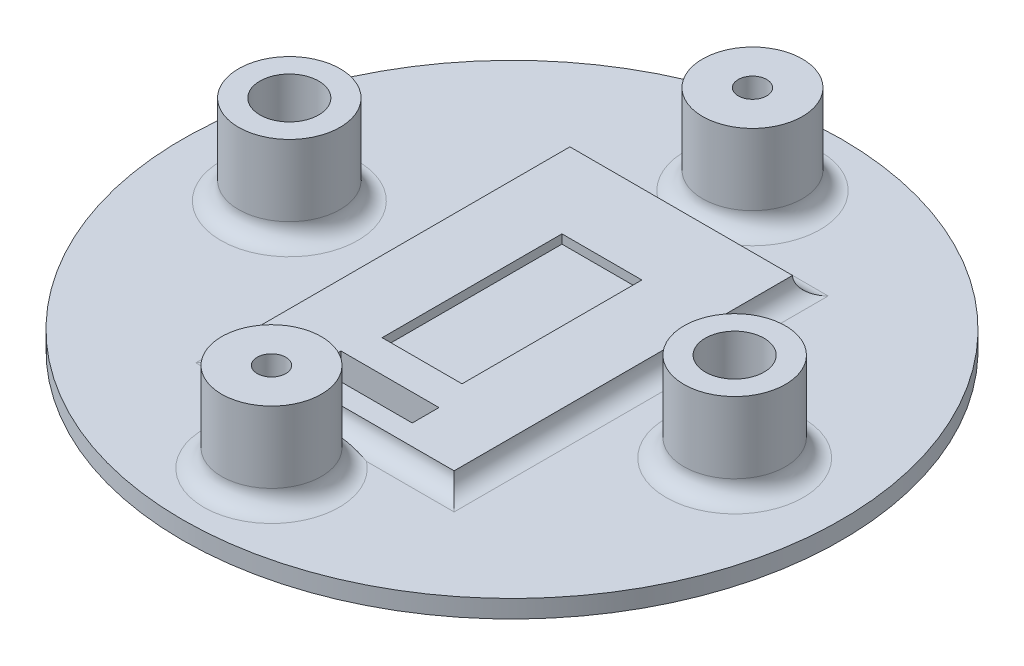
ISO-10303-21;
HEADER;
FILE_DESCRIPTION(('STEP AP214'),'2;1');
FILE_NAME('part.step','',(''),(''),'','','');
FILE_SCHEMA(('AUTOMOTIVE_DESIGN { 1 0 10303 214 1 1 1 1 }'));
ENDSEC;
DATA;
#1=APPLICATION_CONTEXT('core data for automotive mechanical design processes');
#2=APPLICATION_PROTOCOL_DEFINITION('international standard','automotive_design',2000,#1);
#3=PRODUCT_CONTEXT('',#1,'mechanical');
#4=PRODUCT('Part','Part','',(#3));
#5=PRODUCT_RELATED_PRODUCT_CATEGORY('part','',(#4));
#6=PRODUCT_DEFINITION_FORMATION('','',#4);
#7=PRODUCT_DEFINITION_CONTEXT('part definition',#1,'design');
#8=PRODUCT_DEFINITION('design','',#6,#7);
#9=PRODUCT_DEFINITION_SHAPE('','',#8);
#10=(LENGTH_UNIT() NAMED_UNIT(*) SI_UNIT(.MILLI.,.METRE.));
#11=(NAMED_UNIT(*) PLANE_ANGLE_UNIT() SI_UNIT($,.RADIAN.));
#12=(NAMED_UNIT(*) SI_UNIT($,.STERADIAN.) SOLID_ANGLE_UNIT());
#13=UNCERTAINTY_MEASURE_WITH_UNIT(LENGTH_MEASURE(1.E-05),#10,'distance_accuracy_value','');
#14=(GEOMETRIC_REPRESENTATION_CONTEXT(3) GLOBAL_UNCERTAINTY_ASSIGNED_CONTEXT((#13)) GLOBAL_UNIT_ASSIGNED_CONTEXT((#10,
#11,#12)) REPRESENTATION_CONTEXT('',''));
#15=CARTESIAN_POINT('',(0.,0.,0.));
#16=DIRECTION('',(0.,0.,1.));
#17=DIRECTION('',(1.,0.,0.));
#18=AXIS2_PLACEMENT_3D('',#15,#16,#17);
#19=CARTESIAN_POINT('',(0.,12.,-27.));
#20=DIRECTION('',(0.,-1.,0.));
#21=DIRECTION('',(0.,0.,-1.));
#22=AXIS2_PLACEMENT_3D('',#19,#20,#21);
#23=CYLINDRICAL_SURFACE('',#22,1.6);
#24=CARTESIAN_POINT('',(0.,12.,-27.));
#25=DIRECTION('',(0.,1.,0.));
#26=DIRECTION('',(0.,0.,1.));
#27=AXIS2_PLACEMENT_3D('',#24,#25,#26);
#28=CIRCLE('',#27,1.6);
#29=CARTESIAN_POINT('',(0.,12.,-25.4));
#30=VERTEX_POINT('',#29);
#31=EDGE_CURVE('E204',#30,#30,#28,.T.);
#32=ORIENTED_EDGE('',*,*,#31,.T.);
#33=EDGE_LOOP('',(#32));
#34=FACE_BOUND('',#33,.T.);
#35=CARTESIAN_POINT('',(0.,3.75,-27.));
#36=DIRECTION('',(0.,-1.,0.));
#37=DIRECTION('',(0.,0.,-1.));
#38=AXIS2_PLACEMENT_3D('',#35,#36,#37);
#39=CIRCLE('',#38,1.6);
#40=CARTESIAN_POINT('',(0.,3.75,-28.6));
#41=VERTEX_POINT('',#40);
#42=EDGE_CURVE('E188',#41,#41,#39,.F.);
#43=ORIENTED_EDGE('',*,*,#42,.F.);
#44=EDGE_LOOP('',(#43));
#45=FACE_BOUND('',#44,.T.);
#46=ADVANCED_FACE('F33',(#34,#45),#23,.F.);
#47=CARTESIAN_POINT('',(0.,12.,27.));
#48=DIRECTION('',(0.,-1.,0.));
#49=DIRECTION('',(0.,0.,-1.));
#50=AXIS2_PLACEMENT_3D('',#47,#48,#49);
#51=CYLINDRICAL_SURFACE('',#50,1.6);
#52=CARTESIAN_POINT('',(0.,12.,27.));
#53=DIRECTION('',(0.,1.,0.));
#54=DIRECTION('',(0.,0.,1.));
#55=AXIS2_PLACEMENT_3D('',#52,#53,#54);
#56=CIRCLE('',#55,1.6);
#57=CARTESIAN_POINT('',(0.,12.,28.6));
#58=VERTEX_POINT('',#57);
#59=EDGE_CURVE('E198',#58,#58,#56,.T.);
#60=ORIENTED_EDGE('',*,*,#59,.T.);
#61=EDGE_LOOP('',(#60));
#62=FACE_BOUND('',#61,.T.);
#63=CARTESIAN_POINT('',(0.,3.75,27.));
#64=DIRECTION('',(0.,-1.,0.));
#65=DIRECTION('',(0.,0.,-1.));
#66=AXIS2_PLACEMENT_3D('',#63,#64,#65);
#67=CIRCLE('',#66,1.6);
#68=CARTESIAN_POINT('',(0.,3.75,25.4));
#69=VERTEX_POINT('',#68);
#70=EDGE_CURVE('E194',#69,#69,#67,.F.);
#71=ORIENTED_EDGE('',*,*,#70,.F.);
#72=EDGE_LOOP('',(#71));
#73=FACE_BOUND('',#72,.T.);
#74=ADVANCED_FACE('F359',(#62,#73),#51,.F.);
#75=CARTESIAN_POINT('',(0.,2.,0.));
#76=DIRECTION('',(0.,1.,0.));
#77=DIRECTION('',(0.,0.,1.));
#78=AXIS2_PLACEMENT_3D('',#75,#76,#77);
#79=PLANE('',#78);
#80=CARTESIAN_POINT('',(25.,2.,0.));
#81=DIRECTION('',(0.,1.,0.));
#82=DIRECTION('',(0.,0.,1.));
#83=AXIS2_PLACEMENT_3D('',#80,#81,#82);
#84=CIRCLE('',#83,7.7);
#85=CARTESIAN_POINT('',(25.,2.,7.7));
#86=VERTEX_POINT('',#85);
#87=EDGE_CURVE('E299',#86,#86,#84,.F.);
#88=ORIENTED_EDGE('',*,*,#87,.T.);
#89=EDGE_LOOP('',(#88));
#90=FACE_BOUND('',#89,.T.);
#91=CARTESIAN_POINT('',(0.,2.,27.));
#92=DIRECTION('',(0.,1.,0.));
#93=DIRECTION('',(0.,0.,1.));
#94=AXIS2_PLACEMENT_3D('',#91,#92,#93);
#95=CIRCLE('',#94,7.6);
#96=CARTESIAN_POINT('',(4.66476151587624,2.,21.));
#97=VERTEX_POINT('',#96);
#98=CARTESIAN_POINT('',(0.,2.,34.6));
#99=VERTEX_POINT('',#98);
#100=EDGE_CURVE('E60',#97,#99,#95,.F.);
#101=ORIENTED_EDGE('',*,*,#100,.T.);
#102=CARTESIAN_POINT('',(0.,2.,27.));
#103=DIRECTION('',(0.,1.,0.));
#104=DIRECTION('',(0.,0.,1.));
#105=AXIS2_PLACEMENT_3D('',#102,#103,#104);
#106=CIRCLE('',#105,7.6);
#107=CARTESIAN_POINT('',(-4.66476151587624,2.,21.));
#108=VERTEX_POINT('',#107);
#109=EDGE_CURVE('E55',#99,#108,#106,.F.);
#110=ORIENTED_EDGE('',*,*,#109,.T.);
#111=DIRECTION('',(1.,0.,0.));
#112=VECTOR('',#111,1.);
#113=CARTESIAN_POINT('',(0.,2.,21.));
#114=LINE('',#113,#112);
#115=CARTESIAN_POINT('',(-14.5,2.,21.));
#116=VERTEX_POINT('',#115);
#117=EDGE_CURVE('E296',#108,#116,#114,.F.);
#118=ORIENTED_EDGE('',*,*,#117,.T.);
#119=DIRECTION('',(0.,0.,1.));
#120=VECTOR('',#119,1.);
#121=CARTESIAN_POINT('',(-14.5,2.,0.));
#122=LINE('',#121,#120);
#123=CARTESIAN_POINT('',(-14.5,2.,-21.));
#124=VERTEX_POINT('',#123);
#125=EDGE_CURVE('E293',#116,#124,#122,.F.);
#126=ORIENTED_EDGE('',*,*,#125,.T.);
#127=DIRECTION('',(-1.,0.,0.));
#128=VECTOR('',#127,1.);
#129=CARTESIAN_POINT('',(0.,2.,-21.));
#130=LINE('',#129,#128);
#131=CARTESIAN_POINT('',(-4.66476151587625,2.,-21.));
#132=VERTEX_POINT('',#131);
#133=EDGE_CURVE('E286',#124,#132,#130,.F.);
#134=ORIENTED_EDGE('',*,*,#133,.T.);
#135=CARTESIAN_POINT('',(0.,2.,-27.));
#136=DIRECTION('',(0.,1.,0.));
#137=DIRECTION('',(0.,0.,1.));
#138=AXIS2_PLACEMENT_3D('',#135,#136,#137);
#139=CIRCLE('',#138,7.6);
#140=CARTESIAN_POINT('',(4.66476151587625,2.,-21.));
#141=VERTEX_POINT('',#140);
#142=EDGE_CURVE('E282',#132,#141,#139,.F.);
#143=ORIENTED_EDGE('',*,*,#142,.T.);
#144=DIRECTION('',(-1.,0.,0.));
#145=VECTOR('',#144,1.);
#146=CARTESIAN_POINT('',(0.,2.,-21.));
#147=LINE('',#146,#145);
#148=CARTESIAN_POINT('',(14.5,2.,-21.));
#149=VERTEX_POINT('',#148);
#150=EDGE_CURVE('E284',#141,#149,#147,.F.);
#151=ORIENTED_EDGE('',*,*,#150,.T.);
#152=DIRECTION('',(0.,0.,-1.));
#153=VECTOR('',#152,1.);
#154=CARTESIAN_POINT('',(14.5,2.,0.));
#155=LINE('',#154,#153);
#156=CARTESIAN_POINT('',(14.5,2.,21.));
#157=VERTEX_POINT('',#156);
#158=EDGE_CURVE('E288',#149,#157,#155,.F.);
#159=ORIENTED_EDGE('',*,*,#158,.T.);
#160=DIRECTION('',(1.,0.,0.));
#161=VECTOR('',#160,1.);
#162=CARTESIAN_POINT('',(0.,2.,21.));
#163=LINE('',#162,#161);
#164=EDGE_CURVE('E291',#157,#97,#163,.F.);
#165=ORIENTED_EDGE('',*,*,#164,.T.);
#166=EDGE_LOOP('',(#101,#110,#118,#126,#134,#143,#151,#159,#165));
#167=FACE_BOUND('',#166,.T.);
#168=CARTESIAN_POINT('',(-25.,2.,0.));
#169=DIRECTION('',(0.,1.,0.));
#170=DIRECTION('',(0.,0.,1.));
#171=AXIS2_PLACEMENT_3D('',#168,#169,#170);
#172=CIRCLE('',#171,7.7);
#173=CARTESIAN_POINT('',(-25.,2.,7.7));
#174=VERTEX_POINT('',#173);
#175=EDGE_CURVE('E275',#174,#174,#172,.F.);
#176=ORIENTED_EDGE('',*,*,#175,.T.);
#177=EDGE_LOOP('',(#176));
#178=FACE_BOUND('',#177,.T.);
#179=CARTESIAN_POINT('',(0.,2.,0.));
#180=DIRECTION('',(0.,1.,0.));
#181=DIRECTION('',(0.,0.,1.));
#182=AXIS2_PLACEMENT_3D('',#179,#180,#181);
#183=CIRCLE('',#182,37.);
#184=CARTESIAN_POINT('',(0.,2.,37.));
#185=VERTEX_POINT('',#184);
#186=EDGE_CURVE('E264',#185,#185,#183,.T.);
#187=ORIENTED_EDGE('',*,*,#186,.T.);
#188=EDGE_LOOP('',(#187));
#189=FACE_BOUND('',#188,.T.);
#190=ADVANCED_FACE('F365',(#90,#167,#178,#189),#79,.T.);
#191=CARTESIAN_POINT('',(0.,2.,0.));
#192=DIRECTION('',(0.,-1.,0.));
#193=DIRECTION('',(0.,0.,-1.));
#194=AXIS2_PLACEMENT_3D('',#191,#192,#193);
#195=CYLINDRICAL_SURFACE('',#194,37.);
#196=ORIENTED_EDGE('',*,*,#186,.F.);
#197=EDGE_LOOP('',(#196));
#198=FACE_BOUND('',#197,.T.);
#199=CARTESIAN_POINT('',(0.,0.,0.));
#200=DIRECTION('',(0.,1.,0.));
#201=DIRECTION('',(0.,0.,1.));
#202=AXIS2_PLACEMENT_3D('',#199,#200,#201);
#203=CIRCLE('',#202,37.);
#204=CARTESIAN_POINT('',(0.,0.,37.));
#205=VERTEX_POINT('',#204);
#206=EDGE_CURVE('E263',#205,#205,#203,.T.);
#207=ORIENTED_EDGE('',*,*,#206,.T.);
#208=EDGE_LOOP('',(#207));
#209=FACE_BOUND('',#208,.T.);
#210=ADVANCED_FACE('F423',(#198,#209),#195,.T.);
#211=CARTESIAN_POINT('',(0.,0.,0.));
#212=DIRECTION('',(0.,1.,0.));
#213=DIRECTION('',(0.,0.,1.));
#214=AXIS2_PLACEMENT_3D('',#211,#212,#213);
#215=PLANE('',#214);
#216=CARTESIAN_POINT('',(0.,0.,-27.));
#217=DIRECTION('',(0.,-1.,0.));
#218=DIRECTION('',(0.,0.,-1.));
#219=AXIS2_PLACEMENT_3D('',#216,#217,#218);
#220=CIRCLE('',#219,3.75);
#221=CARTESIAN_POINT('',(0.,0.,-30.75));
#222=VERTEX_POINT('',#221);
#223=EDGE_CURVE('E181',#222,#222,#220,.T.);
#224=ORIENTED_EDGE('',*,*,#223,.F.);
#225=EDGE_LOOP('',(#224));
#226=FACE_BOUND('',#225,.T.);
#227=CARTESIAN_POINT('',(0.,0.,27.));
#228=DIRECTION('',(0.,-1.,0.));
#229=DIRECTION('',(0.,0.,-1.));
#230=AXIS2_PLACEMENT_3D('',#227,#228,#229);
#231=CIRCLE('',#230,3.75);
#232=CARTESIAN_POINT('',(0.,0.,23.25));
#233=VERTEX_POINT('',#232);
#234=EDGE_CURVE('E195',#233,#233,#231,.T.);
#235=ORIENTED_EDGE('',*,*,#234,.F.);
#236=EDGE_LOOP('',(#235));
#237=FACE_BOUND('',#236,.T.);
#238=DIRECTION('',(1.,0.,0.));
#239=VECTOR('',#238,1.);
#240=CARTESIAN_POINT('',(-5.49999999999999,0.,16.7));
#241=LINE('',#240,#239);
#242=CARTESIAN_POINT('',(-5.49999999999999,0.,16.7));
#243=VERTEX_POINT('',#242);
#244=CARTESIAN_POINT('',(5.50000000000001,0.,16.7));
#245=VERTEX_POINT('',#244);
#246=EDGE_CURVE('E221',#243,#245,#241,.T.);
#247=ORIENTED_EDGE('',*,*,#246,.T.);
#248=DIRECTION('',(0.,0.,-1.));
#249=VECTOR('',#248,1.);
#250=CARTESIAN_POINT('',(5.50000000000001,0.,16.7));
#251=LINE('',#250,#249);
#252=CARTESIAN_POINT('',(5.50000000000001,0.,13.7));
#253=VERTEX_POINT('',#252);
#254=EDGE_CURVE('E211',#245,#253,#251,.T.);
#255=ORIENTED_EDGE('',*,*,#254,.T.);
#256=DIRECTION('',(-1.,0.,0.));
#257=VECTOR('',#256,1.);
#258=CARTESIAN_POINT('',(-5.49999999999999,0.,13.7));
#259=LINE('',#258,#257);
#260=CARTESIAN_POINT('',(-5.49999999999999,0.,13.7));
#261=VERTEX_POINT('',#260);
#262=EDGE_CURVE('E214',#253,#261,#259,.T.);
#263=ORIENTED_EDGE('',*,*,#262,.T.);
#264=DIRECTION('',(0.,0.,1.));
#265=VECTOR('',#264,1.);
#266=CARTESIAN_POINT('',(-5.49999999999999,0.,16.7));
#267=LINE('',#266,#265);
#268=EDGE_CURVE('E218',#261,#243,#267,.T.);
#269=ORIENTED_EDGE('',*,*,#268,.T.);
#270=EDGE_LOOP('',(#247,#255,#263,#269));
#271=FACE_BOUND('',#270,.T.);
#272=ORIENTED_EDGE('',*,*,#206,.F.);
#273=EDGE_LOOP('',(#272));
#274=FACE_BOUND('',#273,.T.);
#275=ADVANCED_FACE('F416',(#226,#237,#271,#274),#215,.F.);
#276=CARTESIAN_POINT('',(-25.,12.,0.));
#277=DIRECTION('',(0.,1.,0.));
#278=DIRECTION('',(0.,0.,1.));
#279=AXIS2_PLACEMENT_3D('',#276,#277,#278);
#280=PLANE('',#279);
#281=CARTESIAN_POINT('',(-25.,12.,0.));
#282=DIRECTION('',(0.,1.,0.));
#283=DIRECTION('',(0.,0.,1.));
#284=AXIS2_PLACEMENT_3D('',#281,#282,#283);
#285=CIRCLE('',#284,5.7);
#286=CARTESIAN_POINT('',(-25.,12.,5.7));
#287=VERTEX_POINT('',#286);
#288=EDGE_CURVE('E260',#287,#287,#285,.T.);
#289=ORIENTED_EDGE('',*,*,#288,.T.);
#290=EDGE_LOOP('',(#289));
#291=FACE_BOUND('',#290,.T.);
#292=CARTESIAN_POINT('',(-25.,12.,0.));
#293=DIRECTION('',(0.,1.,0.));
#294=DIRECTION('',(0.,0.,1.));
#295=AXIS2_PLACEMENT_3D('',#292,#293,#294);
#296=CIRCLE('',#295,3.3);
#297=CARTESIAN_POINT('',(-25.,12.,3.30000000000001));
#298=VERTEX_POINT('',#297);
#299=EDGE_CURVE('E257',#298,#298,#296,.T.);
#300=ORIENTED_EDGE('',*,*,#299,.F.);
#301=EDGE_LOOP('',(#300));
#302=FACE_BOUND('',#301,.T.);
#303=ADVANCED_FACE('F413',(#291,#302),#280,.T.);
#304=CARTESIAN_POINT('',(-25.,12.,0.));
#305=DIRECTION('',(0.,-1.,0.));
#306=DIRECTION('',(0.,0.,-1.));
#307=AXIS2_PLACEMENT_3D('',#304,#305,#306);
#308=CYLINDRICAL_SURFACE('',#307,5.7);
#309=CARTESIAN_POINT('',(-25.,4.,0.));
#310=DIRECTION('',(0.,1.,0.));
#311=DIRECTION('',(0.,0.,1.));
#312=AXIS2_PLACEMENT_3D('',#309,#310,#311);
#313=CIRCLE('',#312,5.7);
#314=CARTESIAN_POINT('',(-25.,4.,5.7));
#315=VERTEX_POINT('',#314);
#316=EDGE_CURVE('E11',#315,#315,#313,.T.);
#317=ORIENTED_EDGE('',*,*,#316,.T.);
#318=EDGE_LOOP('',(#317));
#319=FACE_BOUND('',#318,.T.);
#320=ORIENTED_EDGE('',*,*,#288,.F.);
#321=EDGE_LOOP('',(#320));
#322=FACE_BOUND('',#321,.T.);
#323=ADVANCED_FACE('F411',(#319,#322),#308,.T.);
#324=CARTESIAN_POINT('',(-25.,12.,0.));
#325=DIRECTION('',(0.,-1.,0.));
#326=DIRECTION('',(0.,0.,-1.));
#327=AXIS2_PLACEMENT_3D('',#324,#325,#326);
#328=CYLINDRICAL_SURFACE('',#327,3.3);
#329=ORIENTED_EDGE('',*,*,#299,.T.);
#330=EDGE_LOOP('',(#329));
#331=FACE_BOUND('',#330,.T.);
#332=CARTESIAN_POINT('',(-25.,2.,0.));
#333=DIRECTION('',(0.,1.,0.));
#334=DIRECTION('',(0.,0.,1.));
#335=AXIS2_PLACEMENT_3D('',#332,#333,#334);
#336=CIRCLE('',#335,3.3);
#337=CARTESIAN_POINT('',(-25.,2.,3.30000000000001));
#338=VERTEX_POINT('',#337);
#339=EDGE_CURVE('E267',#338,#338,#336,.F.);
#340=ORIENTED_EDGE('',*,*,#339,.T.);
#341=EDGE_LOOP('',(#340));
#342=FACE_BOUND('',#341,.T.);
#343=ADVANCED_FACE('F408',(#331,#342),#328,.F.);
#344=ORIENTED_EDGE('',*,*,#339,.F.);
#345=EDGE_LOOP('',(#344));
#346=FACE_BOUND('',#345,.T.);
#347=ADVANCED_FACE('F403',(#346),#79,.T.);
#348=CARTESIAN_POINT('',(25.,12.,0.));
#349=DIRECTION('',(0.,1.,0.));
#350=DIRECTION('',(0.,0.,1.));
#351=AXIS2_PLACEMENT_3D('',#348,#349,#350);
#352=PLANE('',#351);
#353=CARTESIAN_POINT('',(25.,12.,0.));
#354=DIRECTION('',(0.,1.,0.));
#355=DIRECTION('',(0.,0.,1.));
#356=AXIS2_PLACEMENT_3D('',#353,#354,#355);
#357=CIRCLE('',#356,5.7);
#358=CARTESIAN_POINT('',(25.,12.,5.7));
#359=VERTEX_POINT('',#358);
#360=EDGE_CURVE('E254',#359,#359,#357,.T.);
#361=ORIENTED_EDGE('',*,*,#360,.T.);
#362=EDGE_LOOP('',(#361));
#363=FACE_BOUND('',#362,.T.);
#364=CARTESIAN_POINT('',(25.,12.,0.));
#365=DIRECTION('',(0.,1.,0.));
#366=DIRECTION('',(0.,0.,1.));
#367=AXIS2_PLACEMENT_3D('',#364,#365,#366);
#368=CIRCLE('',#367,3.3);
#369=CARTESIAN_POINT('',(25.,12.,3.30000000000001));
#370=VERTEX_POINT('',#369);
#371=EDGE_CURVE('E251',#370,#370,#368,.T.);
#372=ORIENTED_EDGE('',*,*,#371,.F.);
#373=EDGE_LOOP('',(#372));
#374=FACE_BOUND('',#373,.T.);
#375=ADVANCED_FACE('F400',(#363,#374),#352,.T.);
#376=CARTESIAN_POINT('',(25.,12.,0.));
#377=DIRECTION('',(0.,-1.,0.));
#378=DIRECTION('',(0.,0.,-1.));
#379=AXIS2_PLACEMENT_3D('',#376,#377,#378);
#380=CYLINDRICAL_SURFACE('',#379,5.7);
#381=CARTESIAN_POINT('',(25.,4.,0.));
#382=DIRECTION('',(0.,1.,0.));
#383=DIRECTION('',(0.,0.,1.));
#384=AXIS2_PLACEMENT_3D('',#381,#382,#383);
#385=CIRCLE('',#384,5.7);
#386=CARTESIAN_POINT('',(25.,4.,5.7));
#387=VERTEX_POINT('',#386);
#388=EDGE_CURVE('E305',#387,#387,#385,.T.);
#389=ORIENTED_EDGE('',*,*,#388,.T.);
#390=EDGE_LOOP('',(#389));
#391=FACE_BOUND('',#390,.T.);
#392=ORIENTED_EDGE('',*,*,#360,.F.);
#393=EDGE_LOOP('',(#392));
#394=FACE_BOUND('',#393,.T.);
#395=ADVANCED_FACE('F398',(#391,#394),#380,.T.);
#396=CARTESIAN_POINT('',(25.,12.,0.));
#397=DIRECTION('',(0.,-1.,0.));
#398=DIRECTION('',(0.,0.,-1.));
#399=AXIS2_PLACEMENT_3D('',#396,#397,#398);
#400=CYLINDRICAL_SURFACE('',#399,3.3);
#401=ORIENTED_EDGE('',*,*,#371,.T.);
#402=EDGE_LOOP('',(#401));
#403=FACE_BOUND('',#402,.T.);
#404=CARTESIAN_POINT('',(25.,2.,0.));
#405=DIRECTION('',(0.,1.,0.));
#406=DIRECTION('',(0.,0.,1.));
#407=AXIS2_PLACEMENT_3D('',#404,#405,#406);
#408=CIRCLE('',#407,3.3);
#409=CARTESIAN_POINT('',(25.,2.,3.30000000000001));
#410=VERTEX_POINT('',#409);
#411=EDGE_CURVE('E272',#410,#410,#408,.F.);
#412=ORIENTED_EDGE('',*,*,#411,.T.);
#413=EDGE_LOOP('',(#412));
#414=FACE_BOUND('',#413,.T.);
#415=ADVANCED_FACE('F395',(#403,#414),#400,.F.);
#416=ORIENTED_EDGE('',*,*,#411,.F.);
#417=EDGE_LOOP('',(#416));
#418=FACE_BOUND('',#417,.T.);
#419=ADVANCED_FACE('F393',(#418),#79,.T.);
#420=CARTESIAN_POINT('',(0.,4.,0.));
#421=DIRECTION('',(0.,-1.,0.));
#422=DIRECTION('',(0.,0.,-1.));
#423=AXIS2_PLACEMENT_3D('',#420,#421,#422);
#424=PLANE('',#423);
#425=DIRECTION('',(-1.,0.,0.));
#426=VECTOR('',#425,1.);
#427=CARTESIAN_POINT('',(-4.48688989707523,4.,-10.0955022684193));
#428=LINE('',#427,#426);
#429=CARTESIAN_POINT('',(4.48688989707523,4.,-10.0955022684193));
#430=VERTEX_POINT('',#429);
#431=CARTESIAN_POINT('',(-4.48688989707523,4.,-10.0955022684193));
#432=VERTEX_POINT('',#431);
#433=EDGE_CURVE('E175',#430,#432,#428,.T.);
#434=ORIENTED_EDGE('',*,*,#433,.F.);
#435=DIRECTION('',(0.,0.,-1.));
#436=VECTOR('',#435,1.);
#437=CARTESIAN_POINT('',(4.48688989707523,4.,10.0955022684193));
#438=LINE('',#437,#436);
#439=CARTESIAN_POINT('',(4.48688989707523,4.,10.0955022684193));
#440=VERTEX_POINT('',#439);
#441=EDGE_CURVE('E149',#440,#430,#438,.T.);
#442=ORIENTED_EDGE('',*,*,#441,.F.);
#443=DIRECTION('',(1.,0.,0.));
#444=VECTOR('',#443,1.);
#445=CARTESIAN_POINT('',(-4.48688989707523,4.,10.0955022684193));
#446=LINE('',#445,#444);
#447=CARTESIAN_POINT('',(-4.48688989707523,4.,10.0955022684193));
#448=VERTEX_POINT('',#447);
#449=EDGE_CURVE('E166',#448,#440,#446,.T.);
#450=ORIENTED_EDGE('',*,*,#449,.F.);
#451=DIRECTION('',(0.,0.,1.));
#452=VECTOR('',#451,1.);
#453=CARTESIAN_POINT('',(-4.48688989707523,4.,10.0955022684193));
#454=LINE('',#453,#452);
#455=EDGE_CURVE('E169',#432,#448,#454,.T.);
#456=ORIENTED_EDGE('',*,*,#455,.F.);
#457=EDGE_LOOP('',(#434,#442,#450,#456));
#458=FACE_BOUND('',#457,.T.);
#459=DIRECTION('',(-1.,0.,0.));
#460=VECTOR('',#459,1.);
#461=CARTESIAN_POINT('',(-5.49999999999999,4.,13.7));
#462=LINE('',#461,#460);
#463=CARTESIAN_POINT('',(5.50000000000001,4.,13.7));
#464=VERTEX_POINT('',#463);
#465=CARTESIAN_POINT('',(-5.49999999999999,4.,13.7));
#466=VERTEX_POINT('',#465);
#467=EDGE_CURVE('E226',#464,#466,#462,.T.);
#468=ORIENTED_EDGE('',*,*,#467,.F.);
#469=DIRECTION('',(0.,0.,-1.));
#470=VECTOR('',#469,1.);
#471=CARTESIAN_POINT('',(5.50000000000001,4.,16.7));
#472=LINE('',#471,#470);
#473=CARTESIAN_POINT('',(5.50000000000001,4.,16.7));
#474=VERTEX_POINT('',#473);
#475=EDGE_CURVE('E210',#474,#464,#472,.T.);
#476=ORIENTED_EDGE('',*,*,#475,.F.);
#477=DIRECTION('',(1.,0.,0.));
#478=VECTOR('',#477,1.);
#479=CARTESIAN_POINT('',(-5.49999999999999,4.,16.7));
#480=LINE('',#479,#478);
#481=CARTESIAN_POINT('',(-5.49999999999999,4.,16.7));
#482=VERTEX_POINT('',#481);
#483=EDGE_CURVE('E215',#482,#474,#480,.T.);
#484=ORIENTED_EDGE('',*,*,#483,.F.);
#485=DIRECTION('',(0.,0.,1.));
#486=VECTOR('',#485,1.);
#487=CARTESIAN_POINT('',(-5.49999999999999,4.,16.7));
#488=LINE('',#487,#486);
#489=EDGE_CURVE('E229',#466,#482,#488,.T.);
#490=ORIENTED_EDGE('',*,*,#489,.F.);
#491=EDGE_LOOP('',(#468,#476,#484,#490));
#492=FACE_BOUND('',#491,.T.);
#493=DIRECTION('',(0.,0.,-1.));
#494=VECTOR('',#493,1.);
#495=CARTESIAN_POINT('',(12.5,4.,19.));
#496=LINE('',#495,#494);
#497=CARTESIAN_POINT('',(12.5,4.,19.));
#498=VERTEX_POINT('',#497);
#499=CARTESIAN_POINT('',(12.5,4.,-19.));
#500=VERTEX_POINT('',#499);
#501=EDGE_CURVE('E236',#498,#500,#496,.T.);
#502=ORIENTED_EDGE('',*,*,#501,.T.);
#503=DIRECTION('',(-1.,0.,0.));
#504=VECTOR('',#503,1.);
#505=CARTESIAN_POINT('',(-12.5,4.,-19.));
#506=LINE('',#505,#504);
#507=CARTESIAN_POINT('',(-12.5,4.,-19.));
#508=VERTEX_POINT('',#507);
#509=EDGE_CURVE('E245',#500,#508,#506,.T.);
#510=ORIENTED_EDGE('',*,*,#509,.T.);
#511=DIRECTION('',(0.,0.,1.));
#512=VECTOR('',#511,1.);
#513=CARTESIAN_POINT('',(-12.5,4.,19.));
#514=LINE('',#513,#512);
#515=CARTESIAN_POINT('',(-12.5,4.,19.));
#516=VERTEX_POINT('',#515);
#517=EDGE_CURVE('E247',#508,#516,#514,.T.);
#518=ORIENTED_EDGE('',*,*,#517,.T.);
#519=DIRECTION('',(1.,0.,0.));
#520=VECTOR('',#519,1.);
#521=CARTESIAN_POINT('',(-12.5,4.,19.));
#522=LINE('',#521,#520);
#523=EDGE_CURVE('E249',#516,#498,#522,.T.);
#524=ORIENTED_EDGE('',*,*,#523,.T.);
#525=EDGE_LOOP('',(#502,#510,#518,#524));
#526=FACE_BOUND('',#525,.T.);
#527=ADVANCED_FACE('F389',(#458,#492,#526),#424,.F.);
#528=CARTESIAN_POINT('',(5.50000000000001,0.,16.7));
#529=DIRECTION('',(1.,0.,0.));
#530=DIRECTION('',(0.,0.,-1.));
#531=AXIS2_PLACEMENT_3D('',#528,#529,#530);
#532=PLANE('',#531);
#533=ORIENTED_EDGE('',*,*,#475,.T.);
#534=DIRECTION('',(0.,1.,0.));
#535=VECTOR('',#534,1.);
#536=CARTESIAN_POINT('',(5.50000000000001,0.,13.7));
#537=LINE('',#536,#535);
#538=EDGE_CURVE('E224',#253,#464,#537,.T.);
#539=ORIENTED_EDGE('',*,*,#538,.F.);
#540=ORIENTED_EDGE('',*,*,#254,.F.);
#541=DIRECTION('',(0.,1.,0.));
#542=VECTOR('',#541,1.);
#543=CARTESIAN_POINT('',(5.50000000000001,0.,16.7));
#544=LINE('',#543,#542);
#545=EDGE_CURVE('E234',#245,#474,#544,.T.);
#546=ORIENTED_EDGE('',*,*,#545,.T.);
#547=EDGE_LOOP('',(#533,#539,#540,#546));
#548=FACE_BOUND('',#547,.T.);
#549=ADVANCED_FACE('F377',(#548),#532,.F.);
#550=CARTESIAN_POINT('',(-5.49999999999999,0.,16.7));
#551=DIRECTION('',(0.,0.,1.));
#552=DIRECTION('',(1.,0.,0.));
#553=AXIS2_PLACEMENT_3D('',#550,#551,#552);
#554=PLANE('',#553);
#555=ORIENTED_EDGE('',*,*,#483,.T.);
#556=ORIENTED_EDGE('',*,*,#545,.F.);
#557=ORIENTED_EDGE('',*,*,#246,.F.);
#558=DIRECTION('',(0.,1.,0.));
#559=VECTOR('',#558,1.);
#560=CARTESIAN_POINT('',(-5.49999999999999,0.,16.7));
#561=LINE('',#560,#559);
#562=EDGE_CURVE('E237',#243,#482,#561,.T.);
#563=ORIENTED_EDGE('',*,*,#562,.T.);
#564=EDGE_LOOP('',(#555,#556,#557,#563));
#565=FACE_BOUND('',#564,.T.);
#566=ADVANCED_FACE('F373',(#565),#554,.F.);
#567=CARTESIAN_POINT('',(-5.49999999999999,0.,16.7));
#568=DIRECTION('',(-1.,0.,0.));
#569=DIRECTION('',(0.,0.,1.));
#570=AXIS2_PLACEMENT_3D('',#567,#568,#569);
#571=PLANE('',#570);
#572=ORIENTED_EDGE('',*,*,#489,.T.);
#573=ORIENTED_EDGE('',*,*,#562,.F.);
#574=ORIENTED_EDGE('',*,*,#268,.F.);
#575=DIRECTION('',(0.,1.,0.));
#576=VECTOR('',#575,1.);
#577=CARTESIAN_POINT('',(-5.49999999999999,0.,13.7));
#578=LINE('',#577,#576);
#579=EDGE_CURVE('E239',#261,#466,#578,.T.);
#580=ORIENTED_EDGE('',*,*,#579,.T.);
#581=EDGE_LOOP('',(#572,#573,#574,#580));
#582=FACE_BOUND('',#581,.T.);
#583=ADVANCED_FACE('F376',(#582),#571,.F.);
#584=CARTESIAN_POINT('',(-5.49999999999999,0.,13.7));
#585=DIRECTION('',(0.,0.,-1.));
#586=DIRECTION('',(-1.,0.,0.));
#587=AXIS2_PLACEMENT_3D('',#584,#585,#586);
#588=PLANE('',#587);
#589=ORIENTED_EDGE('',*,*,#467,.T.);
#590=ORIENTED_EDGE('',*,*,#579,.F.);
#591=ORIENTED_EDGE('',*,*,#262,.F.);
#592=ORIENTED_EDGE('',*,*,#538,.T.);
#593=EDGE_LOOP('',(#589,#590,#591,#592));
#594=FACE_BOUND('',#593,.T.);
#595=ADVANCED_FACE('F381',(#594),#588,.F.);
#596=CARTESIAN_POINT('',(0.,12.,-27.));
#597=DIRECTION('',(0.,1.,0.));
#598=DIRECTION('',(0.,0.,1.));
#599=AXIS2_PLACEMENT_3D('',#596,#597,#598);
#600=PLANE('',#599);
#601=CARTESIAN_POINT('',(0.,12.,-27.));
#602=DIRECTION('',(0.,1.,0.));
#603=DIRECTION('',(0.,0.,1.));
#604=AXIS2_PLACEMENT_3D('',#601,#602,#603);
#605=CIRCLE('',#604,5.6);
#606=CARTESIAN_POINT('',(0.,12.,-21.4));
#607=VERTEX_POINT('',#606);
#608=EDGE_CURVE('E207',#607,#607,#605,.T.);
#609=ORIENTED_EDGE('',*,*,#608,.T.);
#610=EDGE_LOOP('',(#609));
#611=FACE_BOUND('',#610,.T.);
#612=ORIENTED_EDGE('',*,*,#31,.F.);
#613=EDGE_LOOP('',(#612));
#614=FACE_BOUND('',#613,.T.);
#615=ADVANCED_FACE('F385',(#611,#614),#600,.T.);
#616=CARTESIAN_POINT('',(0.,12.,-27.));
#617=DIRECTION('',(0.,-1.,0.));
#618=DIRECTION('',(0.,0.,-1.));
#619=AXIS2_PLACEMENT_3D('',#616,#617,#618);
#620=CYLINDRICAL_SURFACE('',#619,5.6);
#621=CARTESIAN_POINT('',(0.,4.,-27.));
#622=DIRECTION('',(0.,1.,0.));
#623=DIRECTION('',(0.,0.,1.));
#624=AXIS2_PLACEMENT_3D('',#621,#622,#623);
#625=CIRCLE('',#624,5.6);
#626=CARTESIAN_POINT('',(0.,4.,-21.4));
#627=VERTEX_POINT('',#626);
#628=EDGE_CURVE('E47',#627,#627,#625,.T.);
#629=ORIENTED_EDGE('',*,*,#628,.T.);
#630=EDGE_LOOP('',(#629));
#631=FACE_BOUND('',#630,.T.);
#632=ORIENTED_EDGE('',*,*,#608,.F.);
#633=EDGE_LOOP('',(#632));
#634=FACE_BOUND('',#633,.T.);
#635=ADVANCED_FACE('F370',(#631,#634),#620,.T.);
#636=CARTESIAN_POINT('',(0.,12.,27.));
#637=DIRECTION('',(0.,1.,0.));
#638=DIRECTION('',(0.,0.,1.));
#639=AXIS2_PLACEMENT_3D('',#636,#637,#638);
#640=PLANE('',#639);
#641=CARTESIAN_POINT('',(0.,12.,27.));
#642=DIRECTION('',(0.,1.,0.));
#643=DIRECTION('',(0.,0.,1.));
#644=AXIS2_PLACEMENT_3D('',#641,#642,#643);
#645=CIRCLE('',#644,5.6);
#646=CARTESIAN_POINT('',(0.,12.,32.6));
#647=VERTEX_POINT('',#646);
#648=EDGE_CURVE('E201',#647,#647,#645,.T.);
#649=ORIENTED_EDGE('',*,*,#648,.T.);
#650=EDGE_LOOP('',(#649));
#651=FACE_BOUND('',#650,.T.);
#652=ORIENTED_EDGE('',*,*,#59,.F.);
#653=EDGE_LOOP('',(#652));
#654=FACE_BOUND('',#653,.T.);
#655=ADVANCED_FACE('F514',(#651,#654),#640,.T.);
#656=CARTESIAN_POINT('',(0.,12.,27.));
#657=DIRECTION('',(0.,-1.,0.));
#658=DIRECTION('',(0.,0.,-1.));
#659=AXIS2_PLACEMENT_3D('',#656,#657,#658);
#660=CYLINDRICAL_SURFACE('',#659,5.6);
#661=CARTESIAN_POINT('',(0.,4.,27.));
#662=DIRECTION('',(0.,1.,0.));
#663=DIRECTION('',(0.,0.,1.));
#664=AXIS2_PLACEMENT_3D('',#661,#662,#663);
#665=CIRCLE('',#664,5.6);
#666=CARTESIAN_POINT('',(0.,4.,32.6));
#667=VERTEX_POINT('',#666);
#668=EDGE_CURVE('E302',#667,#667,#665,.T.);
#669=ORIENTED_EDGE('',*,*,#668,.T.);
#670=EDGE_LOOP('',(#669));
#671=FACE_BOUND('',#670,.T.);
#672=ORIENTED_EDGE('',*,*,#648,.F.);
#673=EDGE_LOOP('',(#672));
#674=FACE_BOUND('',#673,.T.);
#675=ADVANCED_FACE('F521',(#671,#674),#660,.T.);
#676=CARTESIAN_POINT('',(0.,3.75,27.));
#677=DIRECTION('',(0.,-1.,0.));
#678=DIRECTION('',(0.,0.,-1.));
#679=AXIS2_PLACEMENT_3D('',#676,#677,#678);
#680=PLANE('',#679);
#681=CARTESIAN_POINT('',(0.,3.75,27.));
#682=DIRECTION('',(0.,-1.,0.));
#683=DIRECTION('',(0.,0.,-1.));
#684=AXIS2_PLACEMENT_3D('',#681,#682,#683);
#685=CIRCLE('',#684,3.75);
#686=CARTESIAN_POINT('',(0.,3.75,23.25));
#687=VERTEX_POINT('',#686);
#688=EDGE_CURVE('E191',#687,#687,#685,.T.);
#689=ORIENTED_EDGE('',*,*,#688,.T.);
#690=EDGE_LOOP('',(#689));
#691=FACE_BOUND('',#690,.T.);
#692=ORIENTED_EDGE('',*,*,#70,.T.);
#693=EDGE_LOOP('',(#692));
#694=FACE_BOUND('',#693,.T.);
#695=ADVANCED_FACE('F528',(#691,#694),#680,.T.);
#696=CARTESIAN_POINT('',(0.,3.75,27.));
#697=DIRECTION('',(0.,-1.,0.));
#698=DIRECTION('',(0.,0.,-1.));
#699=AXIS2_PLACEMENT_3D('',#696,#697,#698);
#700=CYLINDRICAL_SURFACE('',#699,3.75);
#701=ORIENTED_EDGE('',*,*,#688,.F.);
#702=EDGE_LOOP('',(#701));
#703=FACE_BOUND('',#702,.T.);
#704=ORIENTED_EDGE('',*,*,#234,.T.);
#705=EDGE_LOOP('',(#704));
#706=FACE_BOUND('',#705,.T.);
#707=ADVANCED_FACE('F536',(#703,#706),#700,.F.);
#708=CARTESIAN_POINT('',(0.,3.75,-27.));
#709=DIRECTION('',(0.,-1.,0.));
#710=DIRECTION('',(0.,0.,-1.));
#711=AXIS2_PLACEMENT_3D('',#708,#709,#710);
#712=PLANE('',#711);
#713=CARTESIAN_POINT('',(0.,3.75,-27.));
#714=DIRECTION('',(0.,-1.,0.));
#715=DIRECTION('',(0.,0.,-1.));
#716=AXIS2_PLACEMENT_3D('',#713,#714,#715);
#717=CIRCLE('',#716,3.75);
#718=CARTESIAN_POINT('',(0.,3.75,-30.75));
#719=VERTEX_POINT('',#718);
#720=EDGE_CURVE('E185',#719,#719,#717,.T.);
#721=ORIENTED_EDGE('',*,*,#720,.T.);
#722=EDGE_LOOP('',(#721));
#723=FACE_BOUND('',#722,.T.);
#724=ORIENTED_EDGE('',*,*,#42,.T.);
#725=EDGE_LOOP('',(#724));
#726=FACE_BOUND('',#725,.T.);
#727=ADVANCED_FACE('F544',(#723,#726),#712,.T.);
#728=CARTESIAN_POINT('',(0.,3.75,-27.));
#729=DIRECTION('',(0.,-1.,0.));
#730=DIRECTION('',(0.,0.,-1.));
#731=AXIS2_PLACEMENT_3D('',#728,#729,#730);
#732=CYLINDRICAL_SURFACE('',#731,3.75);
#733=ORIENTED_EDGE('',*,*,#720,.F.);
#734=EDGE_LOOP('',(#733));
#735=FACE_BOUND('',#734,.T.);
#736=ORIENTED_EDGE('',*,*,#223,.T.);
#737=EDGE_LOOP('',(#736));
#738=FACE_BOUND('',#737,.T.);
#739=ADVANCED_FACE('F552',(#735,#738),#732,.F.);
#740=CARTESIAN_POINT('',(4.48688989707523,3.,10.0955022684193));
#741=DIRECTION('',(1.,0.,0.));
#742=DIRECTION('',(0.,0.,-1.));
#743=AXIS2_PLACEMENT_3D('',#740,#741,#742);
#744=PLANE('',#743);
#745=ORIENTED_EDGE('',*,*,#441,.T.);
#746=DIRECTION('',(0.,1.,0.));
#747=VECTOR('',#746,1.);
#748=CARTESIAN_POINT('',(4.48688989707523,3.,-10.0955022684193));
#749=LINE('',#748,#747);
#750=CARTESIAN_POINT('',(4.48688989707523,3.,-10.0955022684193));
#751=VERTEX_POINT('',#750);
#752=EDGE_CURVE('E142',#751,#430,#749,.T.);
#753=ORIENTED_EDGE('',*,*,#752,.F.);
#754=DIRECTION('',(0.,0.,-1.));
#755=VECTOR('',#754,1.);
#756=CARTESIAN_POINT('',(4.48688989707523,3.,10.0955022684193));
#757=LINE('',#756,#755);
#758=CARTESIAN_POINT('',(4.48688989707523,3.,10.0955022684193));
#759=VERTEX_POINT('',#758);
#760=EDGE_CURVE('E146',#759,#751,#757,.T.);
#761=ORIENTED_EDGE('',*,*,#760,.F.);
#762=DIRECTION('',(0.,1.,0.));
#763=VECTOR('',#762,1.);
#764=CARTESIAN_POINT('',(4.48688989707523,3.,10.0955022684193));
#765=LINE('',#764,#763);
#766=EDGE_CURVE('E179',#759,#440,#765,.T.);
#767=ORIENTED_EDGE('',*,*,#766,.T.);
#768=EDGE_LOOP('',(#745,#753,#761,#767));
#769=FACE_BOUND('',#768,.T.);
#770=ADVANCED_FACE('F144',(#769),#744,.F.);
#771=CARTESIAN_POINT('',(-4.48688989707523,3.,10.0955022684193));
#772=DIRECTION('',(0.,0.,1.));
#773=DIRECTION('',(1.,0.,0.));
#774=AXIS2_PLACEMENT_3D('',#771,#772,#773);
#775=PLANE('',#774);
#776=ORIENTED_EDGE('',*,*,#449,.T.);
#777=ORIENTED_EDGE('',*,*,#766,.F.);
#778=DIRECTION('',(1.,0.,0.));
#779=VECTOR('',#778,1.);
#780=CARTESIAN_POINT('',(-4.48688989707523,3.,10.0955022684193));
#781=LINE('',#780,#779);
#782=CARTESIAN_POINT('',(-4.48688989707523,3.,10.0955022684193));
#783=VERTEX_POINT('',#782);
#784=EDGE_CURVE('E154',#783,#759,#781,.T.);
#785=ORIENTED_EDGE('',*,*,#784,.F.);
#786=DIRECTION('',(0.,1.,0.));
#787=VECTOR('',#786,1.);
#788=CARTESIAN_POINT('',(-4.48688989707523,3.,10.0955022684193));
#789=LINE('',#788,#787);
#790=EDGE_CURVE('E182',#783,#448,#789,.T.);
#791=ORIENTED_EDGE('',*,*,#790,.T.);
#792=EDGE_LOOP('',(#776,#777,#785,#791));
#793=FACE_BOUND('',#792,.T.);
#794=ADVANCED_FACE('F567',(#793),#775,.F.);
#795=CARTESIAN_POINT('',(-4.48688989707523,3.,10.0955022684193));
#796=DIRECTION('',(-1.,0.,0.));
#797=DIRECTION('',(0.,0.,1.));
#798=AXIS2_PLACEMENT_3D('',#795,#796,#797);
#799=PLANE('',#798);
#800=ORIENTED_EDGE('',*,*,#455,.T.);
#801=ORIENTED_EDGE('',*,*,#790,.F.);
#802=DIRECTION('',(0.,0.,1.));
#803=VECTOR('',#802,1.);
#804=CARTESIAN_POINT('',(-4.48688989707523,3.,10.0955022684193));
#805=LINE('',#804,#803);
#806=CARTESIAN_POINT('',(-4.48688989707523,3.,-10.0955022684193));
#807=VERTEX_POINT('',#806);
#808=EDGE_CURVE('E162',#807,#783,#805,.T.);
#809=ORIENTED_EDGE('',*,*,#808,.F.);
#810=DIRECTION('',(0.,1.,0.));
#811=VECTOR('',#810,1.);
#812=CARTESIAN_POINT('',(-4.48688989707523,3.,-10.0955022684193));
#813=LINE('',#812,#811);
#814=EDGE_CURVE('E153',#807,#432,#813,.T.);
#815=ORIENTED_EDGE('',*,*,#814,.T.);
#816=EDGE_LOOP('',(#800,#801,#809,#815));
#817=FACE_BOUND('',#816,.T.);
#818=ADVANCED_FACE('F574',(#817),#799,.F.);
#819=CARTESIAN_POINT('',(-4.48688989707523,3.,-10.0955022684193));
#820=DIRECTION('',(0.,0.,-1.));
#821=DIRECTION('',(-1.,0.,0.));
#822=AXIS2_PLACEMENT_3D('',#819,#820,#821);
#823=PLANE('',#822);
#824=ORIENTED_EDGE('',*,*,#433,.T.);
#825=ORIENTED_EDGE('',*,*,#814,.F.);
#826=DIRECTION('',(-1.,0.,0.));
#827=VECTOR('',#826,1.);
#828=CARTESIAN_POINT('',(-4.48688989707523,3.,-10.0955022684193));
#829=LINE('',#828,#827);
#830=EDGE_CURVE('E157',#751,#807,#829,.T.);
#831=ORIENTED_EDGE('',*,*,#830,.F.);
#832=ORIENTED_EDGE('',*,*,#752,.T.);
#833=EDGE_LOOP('',(#824,#825,#831,#832));
#834=FACE_BOUND('',#833,.T.);
#835=ADVANCED_FACE('F158',(#834),#823,.F.);
#836=CARTESIAN_POINT('',(0.,3.,0.));
#837=DIRECTION('',(0.,-1.,0.));
#838=DIRECTION('',(0.,0.,-1.));
#839=AXIS2_PLACEMENT_3D('',#836,#837,#838);
#840=PLANE('',#839);
#841=ORIENTED_EDGE('',*,*,#760,.T.);
#842=ORIENTED_EDGE('',*,*,#830,.T.);
#843=ORIENTED_EDGE('',*,*,#808,.T.);
#844=ORIENTED_EDGE('',*,*,#784,.T.);
#845=EDGE_LOOP('',(#841,#842,#843,#844));
#846=FACE_BOUND('',#845,.T.);
#847=ADVANCED_FACE('F164',(#846),#840,.F.);
#848=CARTESIAN_POINT('',(0.,4.,27.));
#849=DIRECTION('',(0.,1.,0.));
#850=DIRECTION('',(0.,0.,1.));
#851=AXIS2_PLACEMENT_3D('',#848,#849,#850);
#852=TOROIDAL_SURFACE('',#851,7.6,2.);
#853=ORIENTED_EDGE('',*,*,#668,.F.);
#854=EDGE_LOOP('',(#853));
#855=FACE_BOUND('',#854,.T.);
#856=ORIENTED_EDGE('',*,*,#109,.F.);
#857=ORIENTED_EDGE('',*,*,#100,.F.);
#858=CARTESIAN_POINT('',(4.66476151587624,2.,21.));
#859=CARTESIAN_POINT('',(4.6611618507263,2.00000000772378,20.9987653225759));
#860=CARTESIAN_POINT('',(4.65756173514754,2.00000115085534,20.9975319223183));
#861=CARTESIAN_POINT('',(4.33478044605788,2.00020483124425,20.8870754042156));
#862=CARTESIAN_POINT('',(4.01206902739116,2.00927742709573,20.7878976917026));
#863=CARTESIAN_POINT('',(3.36090660172013,2.03608806229541,20.6113811552153));
#864=CARTESIAN_POINT('',(3.03245116836169,2.05383309649265,20.5340600395083));
#865=CARTESIAN_POINT('',(2.53615542498238,2.08102785267899,20.4354648759417));
#866=CARTESIAN_POINT('',(2.36999959948575,2.09019583086845,20.4054821520382));
#867=CARTESIAN_POINT('',(2.03668938505839,2.10784881325847,20.3514830648538));
#868=CARTESIAN_POINT('',(1.86953506879237,2.11633386652349,20.3274662726938));
#869=CARTESIAN_POINT('',(1.53445850498167,2.13183596877551,20.2855332171406));
#870=CARTESIAN_POINT('',(1.36653657503988,2.13885357707566,20.2676146277918));
#871=CARTESIAN_POINT('',(1.03007096630659,2.15079353975486,20.2379686020268));
#872=CARTESIAN_POINT('',(0.861527293281022,2.15571591351575,20.22624110834));
#873=CARTESIAN_POINT('',(0.523673965505754,2.16303084068609,20.2090306265628));
#874=CARTESIAN_POINT('',(0.354363440701298,2.16541752452168,20.2035621244345));
#875=CARTESIAN_POINT('',(0.0156391688518456,2.1674246219771,20.198954454989));
#876=CARTESIAN_POINT('',(-0.153774578275989,2.16704503337401,20.1998152927579));
#877=CARTESIAN_POINT('',(-0.49246303822579,2.16355349945775,20.2078616016422));
#878=CARTESIAN_POINT('',(-0.661737708389441,2.160440904215,20.2150485771617));
#879=CARTESIAN_POINT('',(-0.999837536685214,2.1517648664959,20.2357020163487));
#880=CARTESIAN_POINT('',(-1.16866269428512,2.14620142111907,20.2491684874476));
#881=CARTESIAN_POINT('',(-1.5055846925745,2.13312663401026,20.2822947310035));
#882=CARTESIAN_POINT('',(-1.67368170709352,2.1256157865802,20.3019529321079));
#883=CARTESIAN_POINT('',(-2.0089953042561,2.10933189733054,20.3473505597854));
#884=CARTESIAN_POINT('',(-2.17621179613598,2.10055872793316,20.3730906011945));
#885=CARTESIAN_POINT('',(-2.67615758532289,2.07355071176213,20.459222631083));
#886=CARTESIAN_POINT('',(-3.007364277427,2.05461869119589,20.5285445544088));
#887=CARTESIAN_POINT('',(-3.55830419447317,2.02770150490821,20.6636761836833));
#888=CARTESIAN_POINT('',(-3.77949213016316,2.01815562324423,20.7233893552187));
#889=CARTESIAN_POINT('',(-4.21898004461939,2.00437759170833,20.8526319134613));
#890=CARTESIAN_POINT('',(-4.43728259015565,2.00014035336757,20.9221518289144));
#891=CARTESIAN_POINT('',(-4.65756173433842,2.00000114748774,20.9975319228835));
#892=CARTESIAN_POINT('',(-4.66116184997854,2.00000000430987,20.9987653231677));
#893=CARTESIAN_POINT('',(-4.66476151587624,2.,21.));
#894=B_SPLINE_CURVE_WITH_KNOTS('',3,(#858,#859,#860,#861,#862,#863,#864,#865,#866,#867,#868,
#869,#870,#871,#872,#873,#874,#875,#876,#877,#878,#879,#880,#881,#882,#883,#884,#885,#886,#887,
#888,#889,#890,#891,#892,#893),.UNSPECIFIED.,.F.,.F.,(4,2,2,2,2,2,2,2,2,2,2,2,2,2,2,2,2,4),(0.,
0.0114166086417872,1.02346931309678,2.03633965012903,2.54351096864228,3.05064581705612,
3.55758701848536,4.06452353038359,4.57263095094524,5.08073877981432,5.58896747329011,
6.09719676823186,6.60529718727044,7.11344899407915,8.12920729322068,8.8169078152799,
9.50394865342255,9.51536526206433),.UNSPECIFIED.);
#895=EDGE_CURVE('E37',#108,#97,#894,.F.);
#896=ORIENTED_EDGE('',*,*,#895,.F.);
#897=EDGE_LOOP('',(#856,#857,#896));
#898=FACE_BOUND('',#897,.T.);
#899=ADVANCED_FACE('F337',(#855,#898),#852,.F.);
#900=CARTESIAN_POINT('',(-14.5,4.,19.));
#901=DIRECTION('',(0.,0.,1.));
#902=DIRECTION('',(1.,0.,0.));
#903=AXIS2_PLACEMENT_3D('',#900,#901,#902);
#904=CYLINDRICAL_SURFACE('',#903,2.);
#905=CARTESIAN_POINT('',(-14.5,4.,-21.));
#906=DIRECTION('',(-0.707106781186547,0.,0.707106781186547));
#907=DIRECTION('',(0.707106781186547,0.,0.707106781186547));
#908=AXIS2_PLACEMENT_3D('',#905,#906,#907);
#909=ELLIPSE('',#908,2.82842712474619,2.);
#910=EDGE_CURVE('E322',#124,#508,#909,.T.);
#911=ORIENTED_EDGE('',*,*,#910,.F.);
#912=ORIENTED_EDGE('',*,*,#125,.F.);
#913=CARTESIAN_POINT('',(-14.5,4.,21.));
#914=DIRECTION('',(0.707106781186547,0.,0.707106781186547));
#915=DIRECTION('',(0.707106781186547,0.,-0.707106781186547));
#916=AXIS2_PLACEMENT_3D('',#913,#914,#915);
#917=ELLIPSE('',#916,2.82842712474619,2.);
#918=EDGE_CURVE('E737',#516,#116,#917,.F.);
#919=ORIENTED_EDGE('',*,*,#918,.F.);
#920=ORIENTED_EDGE('',*,*,#517,.F.);
#921=EDGE_LOOP('',(#911,#912,#919,#920));
#922=FACE_BOUND('',#921,.T.);
#923=ADVANCED_FACE('F330',(#922),#904,.F.);
#924=CARTESIAN_POINT('',(0.,4.,-27.));
#925=DIRECTION('',(0.,1.,0.));
#926=DIRECTION('',(0.,0.,1.));
#927=AXIS2_PLACEMENT_3D('',#924,#925,#926);
#928=TOROIDAL_SURFACE('',#927,7.6,2.);
#929=ORIENTED_EDGE('',*,*,#628,.F.);
#930=EDGE_LOOP('',(#929));
#931=FACE_BOUND('',#930,.T.);
#932=CARTESIAN_POINT('',(-4.66476151587625,2.,-21.));
#933=CARTESIAN_POINT('',(-4.66116185072631,2.00000000772378,-20.9987653225759));
#934=CARTESIAN_POINT('',(-4.65756173514754,2.00000115085534,-20.9975319223184));
#935=CARTESIAN_POINT('',(-4.33478044605788,2.00020483124425,-20.8870754042157));
#936=CARTESIAN_POINT('',(-4.01206902739115,2.00927742709573,-20.7878976917026));
#937=CARTESIAN_POINT('',(-3.36090660172011,2.03608806229541,-20.6113811552153));
#938=CARTESIAN_POINT('',(-3.03245116836165,2.05383309649266,-20.5340600395083));
#939=CARTESIAN_POINT('',(-2.53615542498234,2.081027852679,-20.4354648759417));
#940=CARTESIAN_POINT('',(-2.36999959948572,2.09019583086845,-20.4054821520382));
#941=CARTESIAN_POINT('',(-2.03668938505838,2.10784881325847,-20.3514830648538));
#942=CARTESIAN_POINT('',(-1.86953506879236,2.11633386652349,-20.3274662726938));
#943=CARTESIAN_POINT('',(-1.53445850498167,2.13183596877551,-20.2855332171406));
#944=CARTESIAN_POINT('',(-1.36653657503989,2.13885357707566,-20.2676146277918));
#945=CARTESIAN_POINT('',(-1.0300709663066,2.15079353975486,-20.2379686020268));
#946=CARTESIAN_POINT('',(-0.861527293281048,2.15571591351576,-20.22624110834));
#947=CARTESIAN_POINT('',(-0.523673965505799,2.16303084068609,-20.2090306265628));
#948=CARTESIAN_POINT('',(-0.354363440701356,2.16541752452168,-20.2035621244345));
#949=CARTESIAN_POINT('',(-0.0156391688519298,2.16742462197711,-20.198954454989));
#950=CARTESIAN_POINT('',(0.153774578275892,2.16704503337401,-20.1998152927579));
#951=CARTESIAN_POINT('',(0.49246303822567,2.16355349945775,-20.2078616016422));
#952=CARTESIAN_POINT('',(0.661737708389311,2.16044090421501,-20.2150485771617));
#953=CARTESIAN_POINT('',(0.999837536685063,2.1517648664959,-20.2357020163487));
#954=CARTESIAN_POINT('',(1.16866269428496,2.14620142111907,-20.2491684874476));
#955=CARTESIAN_POINT('',(1.50558469257434,2.13312663401027,-20.2822947310035));
#956=CARTESIAN_POINT('',(1.67368170709338,2.12561578658021,-20.3019529321079));
#957=CARTESIAN_POINT('',(2.00899530425599,2.10933189733054,-20.3473505597854));
#958=CARTESIAN_POINT('',(2.17621179613588,2.10055872793316,-20.3730906011945));
#959=CARTESIAN_POINT('',(2.67615758532282,2.07355071176214,-20.459222631083));
#960=CARTESIAN_POINT('',(3.00736427742697,2.0546186911959,-20.5285445544087));
#961=CARTESIAN_POINT('',(3.55830419447314,2.02770150490821,-20.6636761836833));
#962=CARTESIAN_POINT('',(3.77949213016311,2.01815562324423,-20.7233893552189));
#963=CARTESIAN_POINT('',(4.21898004461945,2.00437759170833,-20.8526319134611));
#964=CARTESIAN_POINT('',(4.43728259015585,2.00014035336756,-20.9221518289139));
#965=CARTESIAN_POINT('',(4.65756173433844,2.00000114748774,-20.9975319228835));
#966=CARTESIAN_POINT('',(4.66116184997855,2.00000000430987,-20.9987653231677));
#967=CARTESIAN_POINT('',(4.66476151587625,2.,-21.));
#968=B_SPLINE_CURVE_WITH_KNOTS('',3,(#932,#933,#934,#935,#936,#937,#938,#939,#940,#941,#942,
#943,#944,#945,#946,#947,#948,#949,#950,#951,#952,#953,#954,#955,#956,#957,#958,#959,#960,#961,
#962,#963,#964,#965,#966,#967),.UNSPECIFIED.,.F.,.F.,(4,2,2,2,2,2,2,2,2,2,2,2,2,2,2,2,2,4),(0.,
0.0114166086417872,1.0234693130968,2.03633965012908,2.54351096864232,3.05064581705614,
3.55758701848536,4.06452353038356,4.57263095094518,5.08073877981422,5.58896747328998,
6.0971967682317,6.60529718727032,7.11344899407908,8.12920729322065,8.81690781527993,
9.50394865342257,9.51536526206435),.UNSPECIFIED.);
#969=EDGE_CURVE('E314',#141,#132,#968,.F.);
#970=ORIENTED_EDGE('',*,*,#969,.F.);
#971=ORIENTED_EDGE('',*,*,#142,.F.);
#972=EDGE_LOOP('',(#970,#971));
#973=FACE_BOUND('',#972,.T.);
#974=ADVANCED_FACE('F325',(#931,#973),#928,.F.);
#975=CARTESIAN_POINT('',(-12.5,4.,21.));
#976=DIRECTION('',(1.,0.,0.));
#977=DIRECTION('',(0.,0.,-1.));
#978=AXIS2_PLACEMENT_3D('',#975,#976,#977);
#979=CYLINDRICAL_SURFACE('',#978,2.);
#980=ORIENTED_EDGE('',*,*,#895,.T.);
#981=ORIENTED_EDGE('',*,*,#164,.F.);
#982=CARTESIAN_POINT('',(14.5,4.,21.));
#983=DIRECTION('',(0.707106781186547,0.,-0.707106781186547));
#984=DIRECTION('',(0.707106781186547,0.,0.707106781186547));
#985=AXIS2_PLACEMENT_3D('',#982,#983,#984);
#986=ELLIPSE('',#985,2.82842712474619,2.);
#987=EDGE_CURVE('E312',#498,#157,#986,.F.);
#988=ORIENTED_EDGE('',*,*,#987,.F.);
#989=ORIENTED_EDGE('',*,*,#523,.F.);
#990=ORIENTED_EDGE('',*,*,#918,.T.);
#991=ORIENTED_EDGE('',*,*,#117,.F.);
#992=EDGE_LOOP('',(#980,#981,#988,#989,#990,#991));
#993=FACE_BOUND('',#992,.T.);
#994=ADVANCED_FACE('F329',(#993),#979,.F.);
#995=CARTESIAN_POINT('',(-12.5,4.,-21.));
#996=DIRECTION('',(-1.,0.,0.));
#997=DIRECTION('',(0.,0.,1.));
#998=AXIS2_PLACEMENT_3D('',#995,#996,#997);
#999=CYLINDRICAL_SURFACE('',#998,2.);
#1000=ORIENTED_EDGE('',*,*,#910,.T.);
#1001=ORIENTED_EDGE('',*,*,#509,.F.);
#1002=CARTESIAN_POINT('',(14.5,4.,-21.));
#1003=DIRECTION('',(-0.707106781186547,0.,-0.707106781186547));
#1004=DIRECTION('',(-0.707106781186547,0.,0.707106781186547));
#1005=AXIS2_PLACEMENT_3D('',#1002,#1003,#1004);
#1006=ELLIPSE('',#1005,2.82842712474619,2.);
#1007=EDGE_CURVE('E310',#149,#500,#1006,.T.);
#1008=ORIENTED_EDGE('',*,*,#1007,.F.);
#1009=ORIENTED_EDGE('',*,*,#150,.F.);
#1010=ORIENTED_EDGE('',*,*,#969,.T.);
#1011=ORIENTED_EDGE('',*,*,#133,.F.);
#1012=EDGE_LOOP('',(#1000,#1001,#1008,#1009,#1010,#1011));
#1013=FACE_BOUND('',#1012,.T.);
#1014=ADVANCED_FACE('F332',(#1013),#999,.F.);
#1015=CARTESIAN_POINT('',(14.5,4.,19.));
#1016=DIRECTION('',(0.,0.,-1.));
#1017=DIRECTION('',(-1.,0.,0.));
#1018=AXIS2_PLACEMENT_3D('',#1015,#1016,#1017);
#1019=CYLINDRICAL_SURFACE('',#1018,2.);
#1020=ORIENTED_EDGE('',*,*,#987,.T.);
#1021=ORIENTED_EDGE('',*,*,#158,.F.);
#1022=ORIENTED_EDGE('',*,*,#1007,.T.);
#1023=ORIENTED_EDGE('',*,*,#501,.F.);
#1024=EDGE_LOOP('',(#1020,#1021,#1022,#1023));
#1025=FACE_BOUND('',#1024,.T.);
#1026=ADVANCED_FACE('F334',(#1025),#1019,.F.);
#1027=CARTESIAN_POINT('',(25.,4.,0.));
#1028=DIRECTION('',(0.,1.,0.));
#1029=DIRECTION('',(0.,0.,1.));
#1030=AXIS2_PLACEMENT_3D('',#1027,#1028,#1029);
#1031=TOROIDAL_SURFACE('',#1030,7.7,2.);
#1032=ORIENTED_EDGE('',*,*,#87,.F.);
#1033=EDGE_LOOP('',(#1032));
#1034=FACE_BOUND('',#1033,.T.);
#1035=ORIENTED_EDGE('',*,*,#388,.F.);
#1036=EDGE_LOOP('',(#1035));
#1037=FACE_BOUND('',#1036,.T.);
#1038=ADVANCED_FACE('F347',(#1034,#1037),#1031,.F.);
#1039=CARTESIAN_POINT('',(-25.,4.,0.));
#1040=DIRECTION('',(0.,1.,0.));
#1041=DIRECTION('',(0.,0.,1.));
#1042=AXIS2_PLACEMENT_3D('',#1039,#1040,#1041);
#1043=TOROIDAL_SURFACE('',#1042,7.7,2.);
#1044=ORIENTED_EDGE('',*,*,#175,.F.);
#1045=EDGE_LOOP('',(#1044));
#1046=FACE_BOUND('',#1045,.T.);
#1047=ORIENTED_EDGE('',*,*,#316,.F.);
#1048=EDGE_LOOP('',(#1047));
#1049=FACE_BOUND('',#1048,.T.);
#1050=ADVANCED_FACE('F35',(#1046,#1049),#1043,.F.);
#1051=CLOSED_SHELL('',(#46,#74,#190,#210,#275,#303,#323,#343,#347,#375,#395,#415,#419,#527,#549,
#566,#583,#595,#615,#635,#655,#675,#695,#707,#727,#739,#770,#794,#818,#835,#847,#899,#923,#974,
#994,#1014,#1026,#1038,#1050));
#1052=MANIFOLD_SOLID_BREP('B2',#1051);
#1053=ADVANCED_BREP_SHAPE_REPRESENTATION('',(#18,#1052),#14);
#1054=SHAPE_DEFINITION_REPRESENTATION(#9,#1053);
ENDSEC;
END-ISO-10303-21;
